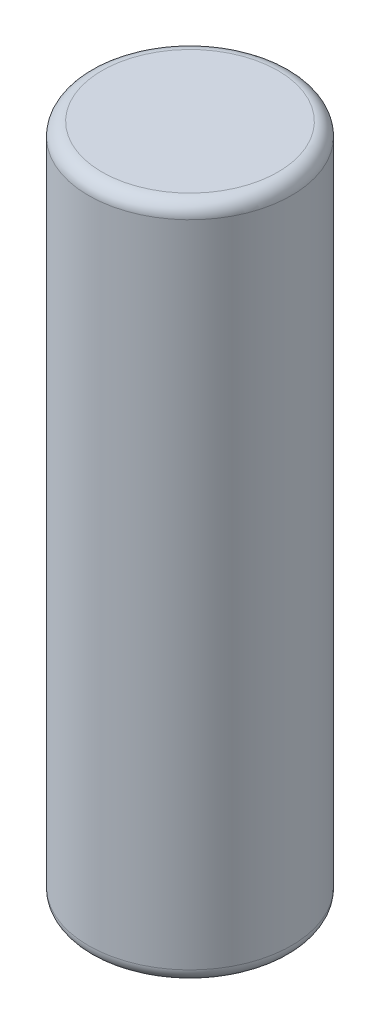
ISO-10303-21;
HEADER;
FILE_DESCRIPTION(('STEP AP214'),'2;1');
FILE_NAME('part.step','',(''),(''),'','','');
FILE_SCHEMA(('AUTOMOTIVE_DESIGN { 1 0 10303 214 1 1 1 1 }'));
ENDSEC;
DATA;
#1=APPLICATION_CONTEXT('core data for automotive mechanical design processes');
#2=APPLICATION_PROTOCOL_DEFINITION('international standard','automotive_design',2000,#1);
#3=PRODUCT_CONTEXT('',#1,'mechanical');
#4=PRODUCT('Part','Part','',(#3));
#5=PRODUCT_RELATED_PRODUCT_CATEGORY('part','',(#4));
#6=PRODUCT_DEFINITION_FORMATION('','',#4);
#7=PRODUCT_DEFINITION_CONTEXT('part definition',#1,'design');
#8=PRODUCT_DEFINITION('design','',#6,#7);
#9=PRODUCT_DEFINITION_SHAPE('','',#8);
#10=(LENGTH_UNIT() NAMED_UNIT(*) SI_UNIT(.MILLI.,.METRE.));
#11=(NAMED_UNIT(*) PLANE_ANGLE_UNIT() SI_UNIT($,.RADIAN.));
#12=(NAMED_UNIT(*) SI_UNIT($,.STERADIAN.) SOLID_ANGLE_UNIT());
#13=UNCERTAINTY_MEASURE_WITH_UNIT(LENGTH_MEASURE(1.E-05),#10,'distance_accuracy_value','');
#14=(GEOMETRIC_REPRESENTATION_CONTEXT(3) GLOBAL_UNCERTAINTY_ASSIGNED_CONTEXT((#13)) GLOBAL_UNIT_ASSIGNED_CONTEXT((#10,
#11,#12)) REPRESENTATION_CONTEXT('',''));
#15=CARTESIAN_POINT('',(0.,0.,0.));
#16=DIRECTION('',(0.,0.,1.));
#17=DIRECTION('',(1.,0.,0.));
#18=AXIS2_PLACEMENT_3D('',#15,#16,#17);
#19=CARTESIAN_POINT('',(0.,10.,0.));
#20=DIRECTION('',(0.,-1.,0.));
#21=DIRECTION('',(0.,0.,-1.));
#22=AXIS2_PLACEMENT_3D('',#19,#20,#21);
#23=CYLINDRICAL_SURFACE('',#22,1.5);
#24=CARTESIAN_POINT('',(0.,0.200000000000001,0.));
#25=DIRECTION('',(0.,1.,0.));
#26=DIRECTION('',(0.,0.,1.));
#27=AXIS2_PLACEMENT_3D('',#24,#25,#26);
#28=CIRCLE('',#27,1.5);
#29=CARTESIAN_POINT('',(0.,0.200000000000001,1.5));
#30=VERTEX_POINT('',#29);
#31=EDGE_CURVE('E42',#30,#30,#28,.T.);
#32=ORIENTED_EDGE('',*,*,#31,.T.);
#33=EDGE_LOOP('',(#32));
#34=FACE_BOUND('',#33,.T.);
#35=CARTESIAN_POINT('',(0.,9.8,0.));
#36=DIRECTION('',(0.,1.,0.));
#37=DIRECTION('',(0.,0.,1.));
#38=AXIS2_PLACEMENT_3D('',#35,#36,#37);
#39=CIRCLE('',#38,1.5);
#40=CARTESIAN_POINT('',(0.,9.8,1.5));
#41=VERTEX_POINT('',#40);
#42=EDGE_CURVE('E46',#41,#41,#39,.F.);
#43=ORIENTED_EDGE('',*,*,#42,.T.);
#44=EDGE_LOOP('',(#43));
#45=FACE_BOUND('',#44,.T.);
#46=ADVANCED_FACE('F31',(#34,#45),#23,.T.);
#47=CARTESIAN_POINT('',(0.,10.,0.));
#48=DIRECTION('',(0.,1.,0.));
#49=DIRECTION('',(0.,0.,1.));
#50=AXIS2_PLACEMENT_3D('',#47,#48,#49);
#51=PLANE('',#50);
#52=CARTESIAN_POINT('',(0.,10.,0.));
#53=DIRECTION('',(0.,1.,0.));
#54=DIRECTION('',(0.,0.,1.));
#55=AXIS2_PLACEMENT_3D('',#52,#53,#54);
#56=CIRCLE('',#55,1.3);
#57=CARTESIAN_POINT('',(0.,10.,1.3));
#58=VERTEX_POINT('',#57);
#59=EDGE_CURVE('E10',#58,#58,#56,.T.);
#60=ORIENTED_EDGE('',*,*,#59,.T.);
#61=EDGE_LOOP('',(#60));
#62=FACE_BOUND('',#61,.T.);
#63=ADVANCED_FACE('F62',(#62),#51,.T.);
#64=CARTESIAN_POINT('',(0.,0.,0.));
#65=DIRECTION('',(0.,1.,0.));
#66=DIRECTION('',(0.,0.,1.));
#67=AXIS2_PLACEMENT_3D('',#64,#65,#66);
#68=PLANE('',#67);
#69=CARTESIAN_POINT('',(0.,0.,0.));
#70=DIRECTION('',(0.,1.,0.));
#71=DIRECTION('',(0.,0.,1.));
#72=AXIS2_PLACEMENT_3D('',#69,#70,#71);
#73=CIRCLE('',#72,1.3);
#74=CARTESIAN_POINT('',(0.,0.,1.3));
#75=VERTEX_POINT('',#74);
#76=EDGE_CURVE('E38',#75,#75,#73,.F.);
#77=ORIENTED_EDGE('',*,*,#76,.T.);
#78=EDGE_LOOP('',(#77));
#79=FACE_BOUND('',#78,.T.);
#80=ADVANCED_FACE('F59',(#79),#68,.F.);
#81=CARTESIAN_POINT('',(0.,0.200000000000001,0.));
#82=DIRECTION('',(0.,1.,0.));
#83=DIRECTION('',(0.,0.,1.));
#84=AXIS2_PLACEMENT_3D('',#81,#82,#83);
#85=TOROIDAL_SURFACE('',#84,1.3,0.2);
#86=ORIENTED_EDGE('',*,*,#76,.F.);
#87=EDGE_LOOP('',(#86));
#88=FACE_BOUND('',#87,.T.);
#89=ORIENTED_EDGE('',*,*,#31,.F.);
#90=EDGE_LOOP('',(#89));
#91=FACE_BOUND('',#90,.T.);
#92=ADVANCED_FACE('F55',(#88,#91),#85,.T.);
#93=CARTESIAN_POINT('',(0.,9.8,0.));
#94=DIRECTION('',(0.,1.,0.));
#95=DIRECTION('',(0.,0.,1.));
#96=AXIS2_PLACEMENT_3D('',#93,#94,#95);
#97=TOROIDAL_SURFACE('',#96,1.3,0.2);
#98=ORIENTED_EDGE('',*,*,#42,.F.);
#99=EDGE_LOOP('',(#98));
#100=FACE_BOUND('',#99,.T.);
#101=ORIENTED_EDGE('',*,*,#59,.F.);
#102=EDGE_LOOP('',(#101));
#103=FACE_BOUND('',#102,.T.);
#104=ADVANCED_FACE('F33',(#100,#103),#97,.T.);
#105=CLOSED_SHELL('',(#46,#63,#80,#92,#104));
#106=MANIFOLD_SOLID_BREP('B2',#105);
#107=ADVANCED_BREP_SHAPE_REPRESENTATION('',(#18,#106),#14);
#108=SHAPE_DEFINITION_REPRESENTATION(#9,#107);
ENDSEC;
END-ISO-10303-21;
